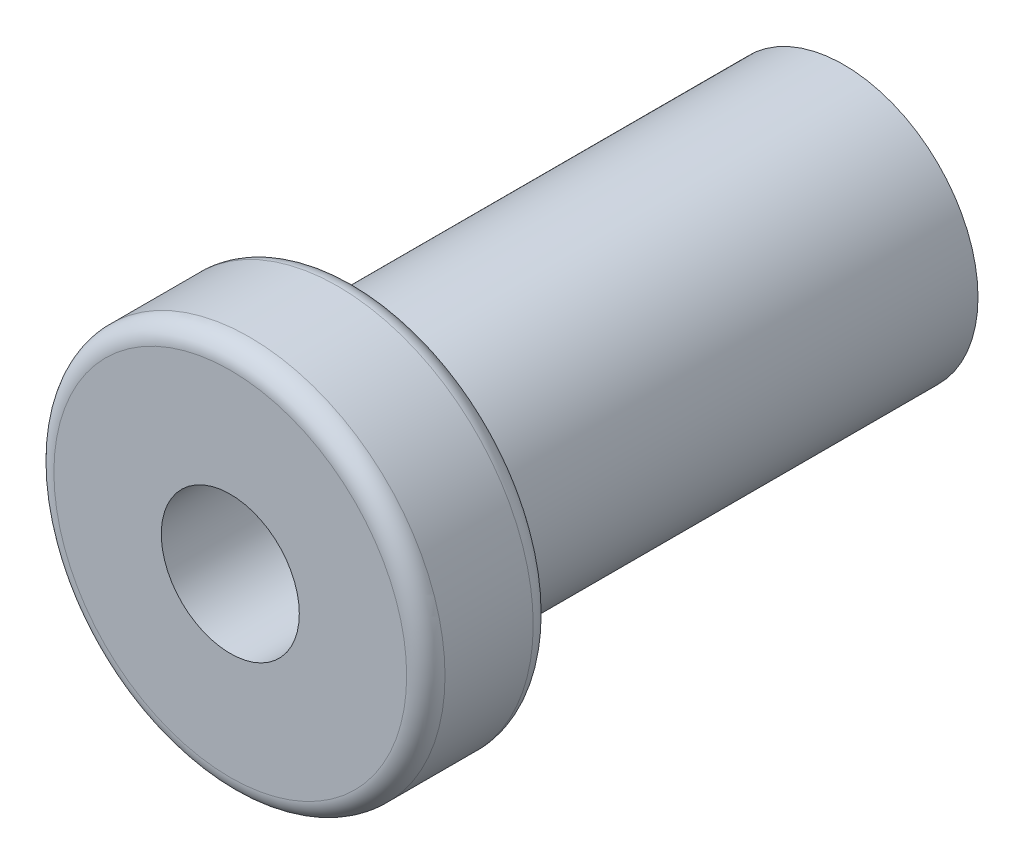
ISO-10303-21;
HEADER;
FILE_DESCRIPTION(('STEP AP214'),'2;1');
FILE_NAME('part.step','',(''),(''),'','','');
FILE_SCHEMA(('AUTOMOTIVE_DESIGN { 1 0 10303 214 1 1 1 1 }'));
ENDSEC;
DATA;
#1=APPLICATION_CONTEXT('core data for automotive mechanical design processes');
#2=APPLICATION_PROTOCOL_DEFINITION('international standard','automotive_design',2000,#1);
#3=PRODUCT_CONTEXT('',#1,'mechanical');
#4=PRODUCT('Part','Part','',(#3));
#5=PRODUCT_RELATED_PRODUCT_CATEGORY('part','',(#4));
#6=PRODUCT_DEFINITION_FORMATION('','',#4);
#7=PRODUCT_DEFINITION_CONTEXT('part definition',#1,'design');
#8=PRODUCT_DEFINITION('design','',#6,#7);
#9=PRODUCT_DEFINITION_SHAPE('','',#8);
#10=(LENGTH_UNIT() NAMED_UNIT(*) SI_UNIT(.MILLI.,.METRE.));
#11=(NAMED_UNIT(*) PLANE_ANGLE_UNIT() SI_UNIT($,.RADIAN.));
#12=(NAMED_UNIT(*) SI_UNIT($,.STERADIAN.) SOLID_ANGLE_UNIT());
#13=UNCERTAINTY_MEASURE_WITH_UNIT(LENGTH_MEASURE(1.E-05),#10,'distance_accuracy_value','');
#14=(GEOMETRIC_REPRESENTATION_CONTEXT(3) GLOBAL_UNCERTAINTY_ASSIGNED_CONTEXT((#13)) GLOBAL_UNIT_ASSIGNED_CONTEXT((#10,
#11,#12)) REPRESENTATION_CONTEXT('',''));
#15=CARTESIAN_POINT('',(0.,0.,0.));
#16=DIRECTION('',(0.,0.,1.));
#17=DIRECTION('',(1.,0.,0.));
#18=AXIS2_PLACEMENT_3D('',#15,#16,#17);
#19=CARTESIAN_POINT('',(0.,0.,3.3));
#20=DIRECTION('',(0.,0.,-1.));
#21=DIRECTION('',(-1.,0.,0.));
#22=AXIS2_PLACEMENT_3D('',#19,#20,#21);
#23=PLANE('',#22);
#24=CARTESIAN_POINT('',(0.,0.,3.3));
#25=DIRECTION('',(0.,0.,1.));
#26=DIRECTION('',(1.,0.,0.));
#27=AXIS2_PLACEMENT_3D('',#24,#25,#26);
#28=CIRCLE('',#27,1.8);
#29=CARTESIAN_POINT('',(1.8,0.,3.3));
#30=VERTEX_POINT('',#29);
#31=EDGE_CURVE('E62',#30,#30,#28,.T.);
#32=ORIENTED_EDGE('',*,*,#31,.F.);
#33=EDGE_LOOP('',(#32));
#34=FACE_BOUND('',#33,.T.);
#35=CARTESIAN_POINT('',(0.,0.,3.3));
#36=DIRECTION('',(0.,0.,-1.));
#37=DIRECTION('',(-1.,0.,0.));
#38=AXIS2_PLACEMENT_3D('',#35,#36,#37);
#39=CIRCLE('',#38,4.6);
#40=CARTESIAN_POINT('',(-4.6,0.,3.3));
#41=VERTEX_POINT('',#40);
#42=EDGE_CURVE('E10',#41,#41,#39,.F.);
#43=ORIENTED_EDGE('',*,*,#42,.T.);
#44=EDGE_LOOP('',(#43));
#45=FACE_BOUND('',#44,.T.);
#46=ADVANCED_FACE('F35',(#34,#45),#23,.F.);
#47=CARTESIAN_POINT('',(0.,0.,-12.7));
#48=DIRECTION('',(0.,0.,-1.));
#49=DIRECTION('',(-1.,0.,0.));
#50=AXIS2_PLACEMENT_3D('',#47,#48,#49);
#51=PLANE('',#50);
#52=CARTESIAN_POINT('',(0.,0.,-12.7));
#53=DIRECTION('',(0.,0.,1.));
#54=DIRECTION('',(1.,0.,0.));
#55=AXIS2_PLACEMENT_3D('',#52,#53,#54);
#56=CIRCLE('',#55,3.5);
#57=CARTESIAN_POINT('',(3.5,0.,-12.7));
#58=VERTEX_POINT('',#57);
#59=EDGE_CURVE('E55',#58,#58,#56,.T.);
#60=ORIENTED_EDGE('',*,*,#59,.F.);
#61=EDGE_LOOP('',(#60));
#62=FACE_BOUND('',#61,.T.);
#63=ADVANCED_FACE('F77',(#62),#51,.T.);
#64=CARTESIAN_POINT('',(0.,0.,0.));
#65=DIRECTION('',(0.,0.,1.));
#66=DIRECTION('',(1.,0.,0.));
#67=AXIS2_PLACEMENT_3D('',#64,#65,#66);
#68=CYLINDRICAL_SURFACE('',#67,3.5);
#69=CARTESIAN_POINT('',(0.,0.,0.));
#70=DIRECTION('',(0.,0.,1.));
#71=DIRECTION('',(1.,0.,0.));
#72=AXIS2_PLACEMENT_3D('',#69,#70,#71);
#73=CIRCLE('',#72,3.5);
#74=CARTESIAN_POINT('',(3.5,0.,0.));
#75=VERTEX_POINT('',#74);
#76=EDGE_CURVE('E58',#75,#75,#73,.T.);
#77=ORIENTED_EDGE('',*,*,#76,.F.);
#78=EDGE_LOOP('',(#77));
#79=FACE_BOUND('',#78,.T.);
#80=ORIENTED_EDGE('',*,*,#59,.T.);
#81=EDGE_LOOP('',(#80));
#82=FACE_BOUND('',#81,.T.);
#83=ADVANCED_FACE('F82',(#79,#82),#68,.T.);
#84=CARTESIAN_POINT('',(0.,0.,0.));
#85=DIRECTION('',(0.,0.,-1.));
#86=DIRECTION('',(-1.,0.,0.));
#87=AXIS2_PLACEMENT_3D('',#84,#85,#86);
#88=PLANE('',#87);
#89=CARTESIAN_POINT('',(0.,0.,0.));
#90=DIRECTION('',(0.,0.,-1.));
#91=DIRECTION('',(-1.,0.,0.));
#92=AXIS2_PLACEMENT_3D('',#89,#90,#91);
#93=CIRCLE('',#92,4.6);
#94=CARTESIAN_POINT('',(-4.6,0.,0.));
#95=VERTEX_POINT('',#94);
#96=EDGE_CURVE('E42',#95,#95,#93,.T.);
#97=ORIENTED_EDGE('',*,*,#96,.T.);
#98=EDGE_LOOP('',(#97));
#99=FACE_BOUND('',#98,.T.);
#100=ORIENTED_EDGE('',*,*,#76,.T.);
#101=EDGE_LOOP('',(#100));
#102=FACE_BOUND('',#101,.T.);
#103=ADVANCED_FACE('F95',(#99,#102),#88,.T.);
#104=CARTESIAN_POINT('',(0.,0.,0.));
#105=DIRECTION('',(0.,0.,1.));
#106=DIRECTION('',(1.,0.,0.));
#107=AXIS2_PLACEMENT_3D('',#104,#105,#106);
#108=CYLINDRICAL_SURFACE('',#107,5.1);
#109=CARTESIAN_POINT('',(0.,0.,0.500000000000001));
#110=DIRECTION('',(0.,0.,-1.));
#111=DIRECTION('',(-1.,0.,0.));
#112=AXIS2_PLACEMENT_3D('',#109,#110,#111);
#113=CIRCLE('',#112,5.1);
#114=CARTESIAN_POINT('',(-5.1,0.,0.500000000000001));
#115=VERTEX_POINT('',#114);
#116=EDGE_CURVE('E46',#115,#115,#113,.F.);
#117=ORIENTED_EDGE('',*,*,#116,.T.);
#118=EDGE_LOOP('',(#117));
#119=FACE_BOUND('',#118,.T.);
#120=CARTESIAN_POINT('',(0.,0.,2.8));
#121=DIRECTION('',(0.,0.,-1.));
#122=DIRECTION('',(-1.,0.,0.));
#123=AXIS2_PLACEMENT_3D('',#120,#121,#122);
#124=CIRCLE('',#123,5.1);
#125=CARTESIAN_POINT('',(-5.1,0.,2.8));
#126=VERTEX_POINT('',#125);
#127=EDGE_CURVE('E50',#126,#126,#124,.T.);
#128=ORIENTED_EDGE('',*,*,#127,.T.);
#129=EDGE_LOOP('',(#128));
#130=FACE_BOUND('',#129,.T.);
#131=ADVANCED_FACE('F88',(#119,#130),#108,.T.);
#132=CARTESIAN_POINT('',(0.,0.,0.500000000000001));
#133=DIRECTION('',(0.,0.,-1.));
#134=DIRECTION('',(-1.,0.,0.));
#135=AXIS2_PLACEMENT_3D('',#132,#133,#134);
#136=TOROIDAL_SURFACE('',#135,4.6,0.5);
#137=ORIENTED_EDGE('',*,*,#96,.F.);
#138=EDGE_LOOP('',(#137));
#139=FACE_BOUND('',#138,.T.);
#140=ORIENTED_EDGE('',*,*,#116,.F.);
#141=EDGE_LOOP('',(#140));
#142=FACE_BOUND('',#141,.T.);
#143=ADVANCED_FACE('F86',(#139,#142),#136,.T.);
#144=CARTESIAN_POINT('',(0.,0.,2.8));
#145=DIRECTION('',(0.,0.,-1.));
#146=DIRECTION('',(-1.,0.,0.));
#147=AXIS2_PLACEMENT_3D('',#144,#145,#146);
#148=TOROIDAL_SURFACE('',#147,4.6,0.5);
#149=ORIENTED_EDGE('',*,*,#127,.F.);
#150=EDGE_LOOP('',(#149));
#151=FACE_BOUND('',#150,.T.);
#152=ORIENTED_EDGE('',*,*,#42,.F.);
#153=EDGE_LOOP('',(#152));
#154=FACE_BOUND('',#153,.T.);
#155=ADVANCED_FACE('F37',(#151,#154),#148,.T.);
#156=CARTESIAN_POINT('',(0.,0.,-10.7));
#157=DIRECTION('',(0.,0.,1.));
#158=DIRECTION('',(1.,0.,0.));
#159=AXIS2_PLACEMENT_3D('',#156,#157,#158);
#160=CYLINDRICAL_SURFACE('',#159,1.8);
#161=CARTESIAN_POINT('',(0.,0.,-10.7));
#162=DIRECTION('',(0.,0.,1.));
#163=DIRECTION('',(1.,0.,0.));
#164=AXIS2_PLACEMENT_3D('',#161,#162,#163);
#165=CIRCLE('',#164,1.8);
#166=CARTESIAN_POINT('',(1.8,0.,-10.7));
#167=VERTEX_POINT('',#166);
#168=EDGE_CURVE('E61',#167,#167,#165,.T.);
#169=ORIENTED_EDGE('',*,*,#168,.F.);
#170=EDGE_LOOP('',(#169));
#171=FACE_BOUND('',#170,.T.);
#172=ORIENTED_EDGE('',*,*,#31,.T.);
#173=EDGE_LOOP('',(#172));
#174=FACE_BOUND('',#173,.T.);
#175=ADVANCED_FACE('F70',(#171,#174),#160,.F.);
#176=CARTESIAN_POINT('',(0.,0.,-10.7));
#177=DIRECTION('',(0.,0.,1.));
#178=DIRECTION('',(1.,0.,0.));
#179=AXIS2_PLACEMENT_3D('',#176,#177,#178);
#180=PLANE('',#179);
#181=ORIENTED_EDGE('',*,*,#168,.T.);
#182=EDGE_LOOP('',(#181));
#183=FACE_BOUND('',#182,.T.);
#184=ADVANCED_FACE('F68',(#183),#180,.T.);
#185=CLOSED_SHELL('',(#46,#63,#83,#103,#131,#143,#155,#175,#184));
#186=MANIFOLD_SOLID_BREP('B2',#185);
#187=ADVANCED_BREP_SHAPE_REPRESENTATION('',(#18,#186),#14);
#188=SHAPE_DEFINITION_REPRESENTATION(#9,#187);
ENDSEC;
END-ISO-10303-21;
